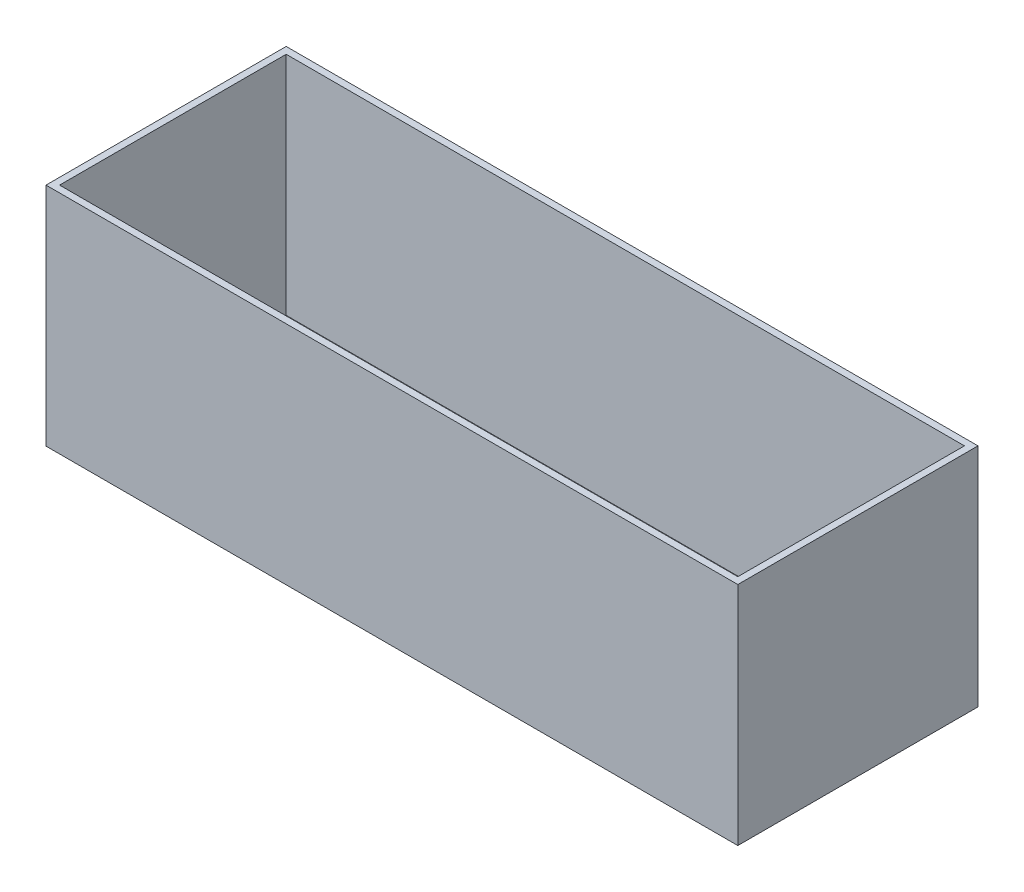
ISO-10303-21;
HEADER;
FILE_DESCRIPTION(('STEP AP214'),'2;1');
FILE_NAME('part.step','',(''),(''),'','','');
FILE_SCHEMA(('AUTOMOTIVE_DESIGN { 1 0 10303 214 1 1 1 1 }'));
ENDSEC;
DATA;
#1=APPLICATION_CONTEXT('core data for automotive mechanical design processes');
#2=APPLICATION_PROTOCOL_DEFINITION('international standard','automotive_design',2000,#1);
#3=PRODUCT_CONTEXT('',#1,'mechanical');
#4=PRODUCT('Part','Part','',(#3));
#5=PRODUCT_RELATED_PRODUCT_CATEGORY('part','',(#4));
#6=PRODUCT_DEFINITION_FORMATION('','',#4);
#7=PRODUCT_DEFINITION_CONTEXT('part definition',#1,'design');
#8=PRODUCT_DEFINITION('design','',#6,#7);
#9=PRODUCT_DEFINITION_SHAPE('','',#8);
#10=(LENGTH_UNIT() NAMED_UNIT(*) SI_UNIT(.MILLI.,.METRE.));
#11=(NAMED_UNIT(*) PLANE_ANGLE_UNIT() SI_UNIT($,.RADIAN.));
#12=(NAMED_UNIT(*) SI_UNIT($,.STERADIAN.) SOLID_ANGLE_UNIT());
#13=UNCERTAINTY_MEASURE_WITH_UNIT(LENGTH_MEASURE(1.E-05),#10,'distance_accuracy_value','');
#14=(GEOMETRIC_REPRESENTATION_CONTEXT(3) GLOBAL_UNCERTAINTY_ASSIGNED_CONTEXT((#13)) GLOBAL_UNIT_ASSIGNED_CONTEXT((#10,
#11,#12)) REPRESENTATION_CONTEXT('',''));
#15=CARTESIAN_POINT('',(0.,0.,0.));
#16=DIRECTION('',(0.,0.,1.));
#17=DIRECTION('',(1.,0.,0.));
#18=AXIS2_PLACEMENT_3D('',#15,#16,#17);
#19=CARTESIAN_POINT('',(0.,100.,0.));
#20=DIRECTION('',(0.,-1.,0.));
#21=DIRECTION('',(0.,0.,-1.));
#22=AXIS2_PLACEMENT_3D('',#19,#20,#21);
#23=PLANE('',#22);
#24=DIRECTION('',(0.,0.,1.));
#25=VECTOR('',#24,1.);
#26=CARTESIAN_POINT('',(-3.,100.,3.));
#27=LINE('',#26,#25);
#28=CARTESIAN_POINT('',(-3.,100.,-103.24));
#29=VERTEX_POINT('',#28);
#30=CARTESIAN_POINT('',(-3.,100.,3.));
#31=VERTEX_POINT('',#30);
#32=EDGE_CURVE('E134',#29,#31,#27,.T.);
#33=ORIENTED_EDGE('',*,*,#32,.T.);
#34=DIRECTION('',(1.,0.,0.));
#35=VECTOR('',#34,1.);
#36=CARTESIAN_POINT('',(303.,100.,3.00000000000001));
#37=LINE('',#36,#35);
#38=CARTESIAN_POINT('',(303.,100.,3.00000000000001));
#39=VERTEX_POINT('',#38);
#40=EDGE_CURVE('E137',#31,#39,#37,.T.);
#41=ORIENTED_EDGE('',*,*,#40,.T.);
#42=DIRECTION('',(0.,0.,-1.));
#43=VECTOR('',#42,1.);
#44=CARTESIAN_POINT('',(303.,100.,-103.24));
#45=LINE('',#44,#43);
#46=CARTESIAN_POINT('',(303.,100.,-103.24));
#47=VERTEX_POINT('',#46);
#48=EDGE_CURVE('E140',#39,#47,#45,.T.);
#49=ORIENTED_EDGE('',*,*,#48,.T.);
#50=DIRECTION('',(-1.,0.,0.));
#51=VECTOR('',#50,1.);
#52=CARTESIAN_POINT('',(-3.,100.,-103.24));
#53=LINE('',#52,#51);
#54=EDGE_CURVE('E142',#47,#29,#53,.T.);
#55=ORIENTED_EDGE('',*,*,#54,.T.);
#56=EDGE_LOOP('',(#33,#41,#49,#55));
#57=FACE_BOUND('',#56,.T.);
#58=DIRECTION('',(1.,0.,0.));
#59=VECTOR('',#58,1.);
#60=CARTESIAN_POINT('',(300.,100.,0.));
#61=LINE('',#60,#59);
#62=CARTESIAN_POINT('',(0.,100.,0.));
#63=VERTEX_POINT('',#62);
#64=CARTESIAN_POINT('',(300.,100.,0.));
#65=VERTEX_POINT('',#64);
#66=EDGE_CURVE('E98',#63,#65,#61,.T.);
#67=ORIENTED_EDGE('',*,*,#66,.F.);
#68=DIRECTION('',(0.,0.,1.));
#69=VECTOR('',#68,1.);
#70=CARTESIAN_POINT('',(0.,100.,0.));
#71=LINE('',#70,#69);
#72=CARTESIAN_POINT('',(0.,100.,-100.24));
#73=VERTEX_POINT('',#72);
#74=EDGE_CURVE('E120',#73,#63,#71,.T.);
#75=ORIENTED_EDGE('',*,*,#74,.F.);
#76=DIRECTION('',(-1.,0.,0.));
#77=VECTOR('',#76,1.);
#78=CARTESIAN_POINT('',(0.,100.,-100.24));
#79=LINE('',#78,#77);
#80=CARTESIAN_POINT('',(300.,100.,-100.24));
#81=VERTEX_POINT('',#80);
#82=EDGE_CURVE('E118',#81,#73,#79,.T.);
#83=ORIENTED_EDGE('',*,*,#82,.F.);
#84=DIRECTION('',(0.,0.,-1.));
#85=VECTOR('',#84,1.);
#86=CARTESIAN_POINT('',(300.,100.,-100.24));
#87=LINE('',#86,#85);
#88=EDGE_CURVE('E106',#65,#81,#87,.T.);
#89=ORIENTED_EDGE('',*,*,#88,.F.);
#90=EDGE_LOOP('',(#67,#75,#83,#89));
#91=FACE_BOUND('',#90,.T.);
#92=ADVANCED_FACE('F33',(#57,#91),#23,.F.);
#93=CARTESIAN_POINT('',(0.,0.,0.));
#94=DIRECTION('',(0.,-1.,0.));
#95=DIRECTION('',(0.,0.,-1.));
#96=AXIS2_PLACEMENT_3D('',#93,#94,#95);
#97=PLANE('',#96);
#98=DIRECTION('',(0.,0.,1.));
#99=VECTOR('',#98,1.);
#100=CARTESIAN_POINT('',(-3.,0.,3.));
#101=LINE('',#100,#99);
#102=CARTESIAN_POINT('',(-3.,0.,-103.24));
#103=VERTEX_POINT('',#102);
#104=CARTESIAN_POINT('',(-3.,0.,3.));
#105=VERTEX_POINT('',#104);
#106=EDGE_CURVE('E114',#103,#105,#101,.T.);
#107=ORIENTED_EDGE('',*,*,#106,.F.);
#108=DIRECTION('',(-1.,0.,0.));
#109=VECTOR('',#108,1.);
#110=CARTESIAN_POINT('',(-3.,0.,-103.24));
#111=LINE('',#110,#109);
#112=CARTESIAN_POINT('',(303.,0.,-103.24));
#113=VERTEX_POINT('',#112);
#114=EDGE_CURVE('E138',#113,#103,#111,.T.);
#115=ORIENTED_EDGE('',*,*,#114,.F.);
#116=DIRECTION('',(0.,0.,-1.));
#117=VECTOR('',#116,1.);
#118=CARTESIAN_POINT('',(303.,0.,-103.24));
#119=LINE('',#118,#117);
#120=CARTESIAN_POINT('',(303.,0.,3.00000000000001));
#121=VERTEX_POINT('',#120);
#122=EDGE_CURVE('E149',#121,#113,#119,.T.);
#123=ORIENTED_EDGE('',*,*,#122,.F.);
#124=DIRECTION('',(1.,0.,0.));
#125=VECTOR('',#124,1.);
#126=CARTESIAN_POINT('',(303.,0.,3.00000000000001));
#127=LINE('',#126,#125);
#128=EDGE_CURVE('E147',#105,#121,#127,.T.);
#129=ORIENTED_EDGE('',*,*,#128,.F.);
#130=EDGE_LOOP('',(#107,#115,#123,#129));
#131=FACE_BOUND('',#130,.T.);
#132=DIRECTION('',(0.,0.,1.));
#133=VECTOR('',#132,1.);
#134=CARTESIAN_POINT('',(0.,0.,0.));
#135=LINE('',#134,#133);
#136=CARTESIAN_POINT('',(0.,0.,-100.24));
#137=VERTEX_POINT('',#136);
#138=CARTESIAN_POINT('',(0.,0.,0.));
#139=VERTEX_POINT('',#138);
#140=EDGE_CURVE('E107',#137,#139,#135,.T.);
#141=ORIENTED_EDGE('',*,*,#140,.T.);
#142=DIRECTION('',(1.,0.,0.));
#143=VECTOR('',#142,1.);
#144=CARTESIAN_POINT('',(300.,0.,0.));
#145=LINE('',#144,#143);
#146=CARTESIAN_POINT('',(300.,0.,0.));
#147=VERTEX_POINT('',#146);
#148=EDGE_CURVE('E56',#139,#147,#145,.T.);
#149=ORIENTED_EDGE('',*,*,#148,.T.);
#150=DIRECTION('',(0.,0.,-1.));
#151=VECTOR('',#150,1.);
#152=CARTESIAN_POINT('',(300.,0.,-100.24));
#153=LINE('',#152,#151);
#154=CARTESIAN_POINT('',(300.,0.,-100.24));
#155=VERTEX_POINT('',#154);
#156=EDGE_CURVE('E113',#147,#155,#153,.T.);
#157=ORIENTED_EDGE('',*,*,#156,.T.);
#158=DIRECTION('',(-1.,0.,0.));
#159=VECTOR('',#158,1.);
#160=CARTESIAN_POINT('',(0.,0.,-100.24));
#161=LINE('',#160,#159);
#162=EDGE_CURVE('E126',#155,#137,#161,.T.);
#163=ORIENTED_EDGE('',*,*,#162,.T.);
#164=EDGE_LOOP('',(#141,#149,#157,#163));
#165=FACE_BOUND('',#164,.T.);
#166=ADVANCED_FACE('F167',(#131,#165),#97,.T.);
#167=CARTESIAN_POINT('',(-3.,100.,3.));
#168=DIRECTION('',(1.,0.,0.));
#169=DIRECTION('',(0.,0.,-1.));
#170=AXIS2_PLACEMENT_3D('',#167,#168,#169);
#171=PLANE('',#170);
#172=ORIENTED_EDGE('',*,*,#106,.T.);
#173=DIRECTION('',(0.,-1.,0.));
#174=VECTOR('',#173,1.);
#175=CARTESIAN_POINT('',(-3.,100.,3.));
#176=LINE('',#175,#174);
#177=EDGE_CURVE('E11',#31,#105,#176,.T.);
#178=ORIENTED_EDGE('',*,*,#177,.F.);
#179=ORIENTED_EDGE('',*,*,#32,.F.);
#180=DIRECTION('',(0.,-1.,0.));
#181=VECTOR('',#180,1.);
#182=CARTESIAN_POINT('',(-3.,100.,-103.24));
#183=LINE('',#182,#181);
#184=EDGE_CURVE('E144',#29,#103,#183,.T.);
#185=ORIENTED_EDGE('',*,*,#184,.T.);
#186=EDGE_LOOP('',(#172,#178,#179,#185));
#187=FACE_BOUND('',#186,.T.);
#188=ADVANCED_FACE('F35',(#187),#171,.F.);
#189=CARTESIAN_POINT('',(303.,100.,3.00000000000001));
#190=DIRECTION('',(0.,0.,-1.));
#191=DIRECTION('',(-1.,0.,0.));
#192=AXIS2_PLACEMENT_3D('',#189,#190,#191);
#193=PLANE('',#192);
#194=ORIENTED_EDGE('',*,*,#128,.T.);
#195=DIRECTION('',(0.,-1.,0.));
#196=VECTOR('',#195,1.);
#197=CARTESIAN_POINT('',(303.,100.,3.00000000000001));
#198=LINE('',#197,#196);
#199=EDGE_CURVE('E41',#39,#121,#198,.T.);
#200=ORIENTED_EDGE('',*,*,#199,.F.);
#201=ORIENTED_EDGE('',*,*,#40,.F.);
#202=ORIENTED_EDGE('',*,*,#177,.T.);
#203=EDGE_LOOP('',(#194,#200,#201,#202));
#204=FACE_BOUND('',#203,.T.);
#205=ADVANCED_FACE('F177',(#204),#193,.F.);
#206=CARTESIAN_POINT('',(303.,100.,-103.24));
#207=DIRECTION('',(-1.,0.,0.));
#208=DIRECTION('',(0.,0.,1.));
#209=AXIS2_PLACEMENT_3D('',#206,#207,#208);
#210=PLANE('',#209);
#211=ORIENTED_EDGE('',*,*,#122,.T.);
#212=DIRECTION('',(0.,-1.,0.));
#213=VECTOR('',#212,1.);
#214=CARTESIAN_POINT('',(303.,100.,-103.24));
#215=LINE('',#214,#213);
#216=EDGE_CURVE('E154',#47,#113,#215,.T.);
#217=ORIENTED_EDGE('',*,*,#216,.F.);
#218=ORIENTED_EDGE('',*,*,#48,.F.);
#219=ORIENTED_EDGE('',*,*,#199,.T.);
#220=EDGE_LOOP('',(#211,#217,#218,#219));
#221=FACE_BOUND('',#220,.T.);
#222=ADVANCED_FACE('F161',(#221),#210,.F.);
#223=CARTESIAN_POINT('',(-3.,100.,-103.24));
#224=DIRECTION('',(0.,0.,1.));
#225=DIRECTION('',(1.,0.,0.));
#226=AXIS2_PLACEMENT_3D('',#223,#224,#225);
#227=PLANE('',#226);
#228=ORIENTED_EDGE('',*,*,#114,.T.);
#229=ORIENTED_EDGE('',*,*,#184,.F.);
#230=ORIENTED_EDGE('',*,*,#54,.F.);
#231=ORIENTED_EDGE('',*,*,#216,.T.);
#232=EDGE_LOOP('',(#228,#229,#230,#231));
#233=FACE_BOUND('',#232,.T.);
#234=ADVANCED_FACE('F171',(#233),#227,.F.);
#235=CARTESIAN_POINT('',(300.,100.,0.));
#236=DIRECTION('',(0.,0.,-1.));
#237=DIRECTION('',(-1.,0.,0.));
#238=AXIS2_PLACEMENT_3D('',#235,#236,#237);
#239=PLANE('',#238);
#240=ORIENTED_EDGE('',*,*,#148,.F.);
#241=DIRECTION('',(0.,-1.,0.));
#242=VECTOR('',#241,1.);
#243=CARTESIAN_POINT('',(0.,100.,0.));
#244=LINE('',#243,#242);
#245=EDGE_CURVE('E102',#63,#139,#244,.T.);
#246=ORIENTED_EDGE('',*,*,#245,.F.);
#247=ORIENTED_EDGE('',*,*,#66,.T.);
#248=DIRECTION('',(0.,-1.,0.));
#249=VECTOR('',#248,1.);
#250=CARTESIAN_POINT('',(300.,100.,0.));
#251=LINE('',#250,#249);
#252=EDGE_CURVE('E101',#65,#147,#251,.T.);
#253=ORIENTED_EDGE('',*,*,#252,.T.);
#254=EDGE_LOOP('',(#240,#246,#247,#253));
#255=FACE_BOUND('',#254,.T.);
#256=ADVANCED_FACE('F100',(#255),#239,.T.);
#257=CARTESIAN_POINT('',(300.,100.,-100.24));
#258=DIRECTION('',(-1.,0.,0.));
#259=DIRECTION('',(0.,0.,1.));
#260=AXIS2_PLACEMENT_3D('',#257,#258,#259);
#261=PLANE('',#260);
#262=ORIENTED_EDGE('',*,*,#156,.F.);
#263=ORIENTED_EDGE('',*,*,#252,.F.);
#264=ORIENTED_EDGE('',*,*,#88,.T.);
#265=DIRECTION('',(0.,-1.,0.));
#266=VECTOR('',#265,1.);
#267=CARTESIAN_POINT('',(300.,100.,-100.24));
#268=LINE('',#267,#266);
#269=EDGE_CURVE('E115',#81,#155,#268,.T.);
#270=ORIENTED_EDGE('',*,*,#269,.T.);
#271=EDGE_LOOP('',(#262,#263,#264,#270));
#272=FACE_BOUND('',#271,.T.);
#273=ADVANCED_FACE('F110',(#272),#261,.T.);
#274=CARTESIAN_POINT('',(0.,100.,-100.24));
#275=DIRECTION('',(0.,0.,1.));
#276=DIRECTION('',(1.,0.,0.));
#277=AXIS2_PLACEMENT_3D('',#274,#275,#276);
#278=PLANE('',#277);
#279=ORIENTED_EDGE('',*,*,#162,.F.);
#280=ORIENTED_EDGE('',*,*,#269,.F.);
#281=ORIENTED_EDGE('',*,*,#82,.T.);
#282=DIRECTION('',(0.,-1.,0.));
#283=VECTOR('',#282,1.);
#284=CARTESIAN_POINT('',(0.,100.,-100.24));
#285=LINE('',#284,#283);
#286=EDGE_CURVE('E48',#73,#137,#285,.T.);
#287=ORIENTED_EDGE('',*,*,#286,.T.);
#288=EDGE_LOOP('',(#279,#280,#281,#287));
#289=FACE_BOUND('',#288,.T.);
#290=ADVANCED_FACE('F200',(#289),#278,.T.);
#291=CARTESIAN_POINT('',(0.,100.,0.));
#292=DIRECTION('',(1.,0.,0.));
#293=DIRECTION('',(0.,0.,-1.));
#294=AXIS2_PLACEMENT_3D('',#291,#292,#293);
#295=PLANE('',#294);
#296=ORIENTED_EDGE('',*,*,#140,.F.);
#297=ORIENTED_EDGE('',*,*,#286,.F.);
#298=ORIENTED_EDGE('',*,*,#74,.T.);
#299=ORIENTED_EDGE('',*,*,#245,.T.);
#300=EDGE_LOOP('',(#296,#297,#298,#299));
#301=FACE_BOUND('',#300,.T.);
#302=ADVANCED_FACE('F204',(#301),#295,.T.);
#303=CLOSED_SHELL('',(#92,#166,#188,#205,#222,#234,#256,#273,#290,#302));
#304=MANIFOLD_SOLID_BREP('B2',#303);
#305=ADVANCED_BREP_SHAPE_REPRESENTATION('',(#18,#304),#14);
#306=SHAPE_DEFINITION_REPRESENTATION(#9,#305);
ENDSEC;
END-ISO-10303-21;
